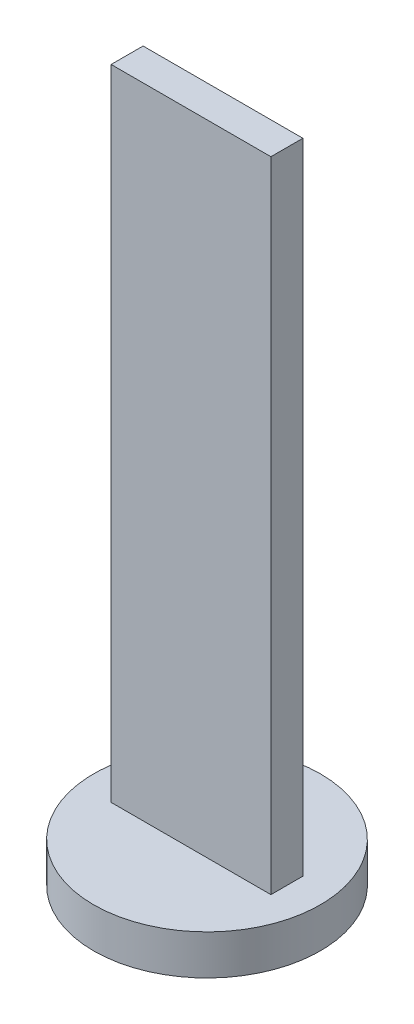
ISO-10303-21;
HEADER;
FILE_DESCRIPTION(('STEP AP214'),'2;1');
FILE_NAME('part.step','',(''),(''),'','','');
FILE_SCHEMA(('AUTOMOTIVE_DESIGN { 1 0 10303 214 1 1 1 1 }'));
ENDSEC;
DATA;
#1=APPLICATION_CONTEXT('core data for automotive mechanical design processes');
#2=APPLICATION_PROTOCOL_DEFINITION('international standard','automotive_design',2000,#1);
#3=PRODUCT_CONTEXT('',#1,'mechanical');
#4=PRODUCT('Part','Part','',(#3));
#5=PRODUCT_RELATED_PRODUCT_CATEGORY('part','',(#4));
#6=PRODUCT_DEFINITION_FORMATION('','',#4);
#7=PRODUCT_DEFINITION_CONTEXT('part definition',#1,'design');
#8=PRODUCT_DEFINITION('design','',#6,#7);
#9=PRODUCT_DEFINITION_SHAPE('','',#8);
#10=(LENGTH_UNIT() NAMED_UNIT(*) SI_UNIT(.MILLI.,.METRE.));
#11=(NAMED_UNIT(*) PLANE_ANGLE_UNIT() SI_UNIT($,.RADIAN.));
#12=(NAMED_UNIT(*) SI_UNIT($,.STERADIAN.) SOLID_ANGLE_UNIT());
#13=UNCERTAINTY_MEASURE_WITH_UNIT(LENGTH_MEASURE(1.E-05),#10,'distance_accuracy_value','');
#14=(GEOMETRIC_REPRESENTATION_CONTEXT(3) GLOBAL_UNCERTAINTY_ASSIGNED_CONTEXT((#13)) GLOBAL_UNIT_ASSIGNED_CONTEXT((#10,
#11,#12)) REPRESENTATION_CONTEXT('',''));
#15=CARTESIAN_POINT('',(0.,0.,0.));
#16=DIRECTION('',(0.,0.,1.));
#17=DIRECTION('',(1.,0.,0.));
#18=AXIS2_PLACEMENT_3D('',#15,#16,#17);
#19=CARTESIAN_POINT('',(0.5,-2.,0.1));
#20=DIRECTION('',(-1.,0.,0.));
#21=DIRECTION('',(0.,-1.,0.));
#22=AXIS2_PLACEMENT_3D('',#19,#20,#21);
#23=PLANE('',#22);
#24=DIRECTION('',(0.,1.,0.));
#25=VECTOR('',#24,1.);
#26=CARTESIAN_POINT('',(0.5,-2.,-0.1));
#27=LINE('',#26,#25);
#28=CARTESIAN_POINT('',(0.500000000000001,-2.,-0.1));
#29=VERTEX_POINT('',#28);
#30=CARTESIAN_POINT('',(0.500000000000001,2.,-0.1));
#31=VERTEX_POINT('',#30);
#32=EDGE_CURVE('E80',#29,#31,#27,.T.);
#33=ORIENTED_EDGE('',*,*,#32,.T.);
#34=DIRECTION('',(0.,0.,-1.));
#35=VECTOR('',#34,1.);
#36=CARTESIAN_POINT('',(0.500000000000001,2.,0.1));
#37=LINE('',#36,#35);
#38=CARTESIAN_POINT('',(0.500000000000001,2.,0.1));
#39=VERTEX_POINT('',#38);
#40=EDGE_CURVE('E11',#39,#31,#37,.T.);
#41=ORIENTED_EDGE('',*,*,#40,.F.);
#42=DIRECTION('',(0.,1.,0.));
#43=VECTOR('',#42,1.);
#44=CARTESIAN_POINT('',(0.5,-2.,0.1));
#45=LINE('',#44,#43);
#46=CARTESIAN_POINT('',(0.5,-2.,0.1));
#47=VERTEX_POINT('',#46);
#48=EDGE_CURVE('E92',#47,#39,#45,.T.);
#49=ORIENTED_EDGE('',*,*,#48,.F.);
#50=DIRECTION('',(0.,0.,-1.));
#51=VECTOR('',#50,1.);
#52=CARTESIAN_POINT('',(0.5,-2.,0.1));
#53=LINE('',#52,#51);
#54=EDGE_CURVE('E91',#47,#29,#53,.T.);
#55=ORIENTED_EDGE('',*,*,#54,.T.);
#56=EDGE_LOOP('',(#33,#41,#49,#55));
#57=FACE_BOUND('',#56,.T.);
#58=ADVANCED_FACE('F34',(#57),#23,.F.);
#59=CARTESIAN_POINT('',(-0.5,2.,0.1));
#60=DIRECTION('',(0.,-1.,0.));
#61=DIRECTION('',(1.,0.,0.));
#62=AXIS2_PLACEMENT_3D('',#59,#60,#61);
#63=PLANE('',#62);
#64=DIRECTION('',(-1.,0.,0.));
#65=VECTOR('',#64,1.);
#66=CARTESIAN_POINT('',(-0.5,2.,-0.1));
#67=LINE('',#66,#65);
#68=CARTESIAN_POINT('',(-0.5,2.,-0.1));
#69=VERTEX_POINT('',#68);
#70=EDGE_CURVE('E63',#31,#69,#67,.T.);
#71=ORIENTED_EDGE('',*,*,#70,.T.);
#72=DIRECTION('',(0.,0.,-1.));
#73=VECTOR('',#72,1.);
#74=CARTESIAN_POINT('',(-0.5,2.,0.1));
#75=LINE('',#74,#73);
#76=CARTESIAN_POINT('',(-0.5,2.,0.1));
#77=VERTEX_POINT('',#76);
#78=EDGE_CURVE('E42',#77,#69,#75,.T.);
#79=ORIENTED_EDGE('',*,*,#78,.F.);
#80=DIRECTION('',(-1.,0.,0.));
#81=VECTOR('',#80,1.);
#82=CARTESIAN_POINT('',(-0.5,2.,0.1));
#83=LINE('',#82,#81);
#84=EDGE_CURVE('E75',#39,#77,#83,.T.);
#85=ORIENTED_EDGE('',*,*,#84,.F.);
#86=ORIENTED_EDGE('',*,*,#40,.T.);
#87=EDGE_LOOP('',(#71,#79,#85,#86));
#88=FACE_BOUND('',#87,.T.);
#89=ADVANCED_FACE('F105',(#88),#63,.F.);
#90=CARTESIAN_POINT('',(-0.5,-2.,0.1));
#91=DIRECTION('',(1.,0.,0.));
#92=DIRECTION('',(0.,0.,-1.));
#93=AXIS2_PLACEMENT_3D('',#90,#91,#92);
#94=PLANE('',#93);
#95=DIRECTION('',(0.,-1.,0.));
#96=VECTOR('',#95,1.);
#97=CARTESIAN_POINT('',(-0.5,-2.,-0.1));
#98=LINE('',#97,#96);
#99=CARTESIAN_POINT('',(-0.5,-2.,-0.1));
#100=VERTEX_POINT('',#99);
#101=EDGE_CURVE('E70',#69,#100,#98,.T.);
#102=ORIENTED_EDGE('',*,*,#101,.T.);
#103=DIRECTION('',(0.,0.,-1.));
#104=VECTOR('',#103,1.);
#105=CARTESIAN_POINT('',(-0.5,-2.,0.1));
#106=LINE('',#105,#104);
#107=CARTESIAN_POINT('',(-0.5,-2.,0.1));
#108=VERTEX_POINT('',#107);
#109=EDGE_CURVE('E94',#108,#100,#106,.T.);
#110=ORIENTED_EDGE('',*,*,#109,.F.);
#111=DIRECTION('',(0.,-1.,0.));
#112=VECTOR('',#111,1.);
#113=CARTESIAN_POINT('',(-0.5,-2.,0.1));
#114=LINE('',#113,#112);
#115=EDGE_CURVE('E104',#77,#108,#114,.T.);
#116=ORIENTED_EDGE('',*,*,#115,.F.);
#117=ORIENTED_EDGE('',*,*,#78,.T.);
#118=EDGE_LOOP('',(#102,#110,#116,#117));
#119=FACE_BOUND('',#118,.T.);
#120=ADVANCED_FACE('F103',(#119),#94,.F.);
#121=CARTESIAN_POINT('',(0.,0.,0.1));
#122=DIRECTION('',(0.,0.,-1.));
#123=DIRECTION('',(-1.,0.,0.));
#124=AXIS2_PLACEMENT_3D('',#121,#122,#123);
#125=PLANE('',#124);
#126=ORIENTED_EDGE('',*,*,#48,.T.);
#127=ORIENTED_EDGE('',*,*,#84,.T.);
#128=ORIENTED_EDGE('',*,*,#115,.T.);
#129=DIRECTION('',(1.,0.,0.));
#130=VECTOR('',#129,1.);
#131=CARTESIAN_POINT('',(-0.5,-2.,0.1));
#132=LINE('',#131,#130);
#133=EDGE_CURVE('E50',#108,#47,#132,.T.);
#134=ORIENTED_EDGE('',*,*,#133,.T.);
#135=EDGE_LOOP('',(#126,#127,#128,#134));
#136=FACE_BOUND('',#135,.T.);
#137=ADVANCED_FACE('F111',(#136),#125,.F.);
#138=CARTESIAN_POINT('',(0.,0.,-0.1));
#139=DIRECTION('',(0.,0.,-1.));
#140=DIRECTION('',(-1.,0.,0.));
#141=AXIS2_PLACEMENT_3D('',#138,#139,#140);
#142=PLANE('',#141);
#143=ORIENTED_EDGE('',*,*,#32,.F.);
#144=DIRECTION('',(1.,0.,0.));
#145=VECTOR('',#144,1.);
#146=CARTESIAN_POINT('',(-0.5,-2.,-0.1));
#147=LINE('',#146,#145);
#148=EDGE_CURVE('E84',#100,#29,#147,.T.);
#149=ORIENTED_EDGE('',*,*,#148,.F.);
#150=ORIENTED_EDGE('',*,*,#101,.F.);
#151=ORIENTED_EDGE('',*,*,#70,.F.);
#152=EDGE_LOOP('',(#143,#149,#150,#151));
#153=FACE_BOUND('',#152,.T.);
#154=ADVANCED_FACE('F82',(#153),#142,.T.);
#155=CARTESIAN_POINT('',(0.,-2.,0.));
#156=DIRECTION('',(0.,-1.,0.));
#157=DIRECTION('',(0.,0.,-1.));
#158=AXIS2_PLACEMENT_3D('',#155,#156,#157);
#159=PLANE('',#158);
#160=CARTESIAN_POINT('',(0.,-2.,0.));
#161=DIRECTION('',(0.,-1.,0.));
#162=DIRECTION('',(0.,0.,-1.));
#163=AXIS2_PLACEMENT_3D('',#160,#161,#162);
#164=CIRCLE('',#163,0.709901951359279);
#165=CARTESIAN_POINT('',(0.,-2.,-0.709901951359279));
#166=VERTEX_POINT('',#165);
#167=EDGE_CURVE('E132',#166,#166,#164,.T.);
#168=ORIENTED_EDGE('',*,*,#167,.F.);
#169=EDGE_LOOP('',(#168));
#170=FACE_BOUND('',#169,.T.);
#171=ORIENTED_EDGE('',*,*,#54,.F.);
#172=ORIENTED_EDGE('',*,*,#133,.F.);
#173=ORIENTED_EDGE('',*,*,#109,.T.);
#174=ORIENTED_EDGE('',*,*,#148,.T.);
#175=EDGE_LOOP('',(#171,#172,#173,#174));
#176=FACE_BOUND('',#175,.T.);
#177=ADVANCED_FACE('F96',(#170,#176),#159,.F.);
#178=CARTESIAN_POINT('',(0.,-2.25,0.));
#179=DIRECTION('',(0.,1.,0.));
#180=DIRECTION('',(0.,0.,1.));
#181=AXIS2_PLACEMENT_3D('',#178,#179,#180);
#182=CYLINDRICAL_SURFACE('',#181,0.709901951359279);
#183=CARTESIAN_POINT('',(0.,-2.25,0.));
#184=DIRECTION('',(0.,-1.,0.));
#185=DIRECTION('',(0.,0.,-1.));
#186=AXIS2_PLACEMENT_3D('',#183,#184,#185);
#187=CIRCLE('',#186,0.709901951359279);
#188=CARTESIAN_POINT('',(0.,-2.25,-0.709901951359279));
#189=VERTEX_POINT('',#188);
#190=EDGE_CURVE('E88',#189,#189,#187,.T.);
#191=ORIENTED_EDGE('',*,*,#190,.F.);
#192=EDGE_LOOP('',(#191));
#193=FACE_BOUND('',#192,.T.);
#194=ORIENTED_EDGE('',*,*,#167,.T.);
#195=EDGE_LOOP('',(#194));
#196=FACE_BOUND('',#195,.T.);
#197=ADVANCED_FACE('F118',(#193,#196),#182,.T.);
#198=CARTESIAN_POINT('',(0.,-2.25,0.));
#199=DIRECTION('',(0.,-1.,0.));
#200=DIRECTION('',(0.,0.,-1.));
#201=AXIS2_PLACEMENT_3D('',#198,#199,#200);
#202=PLANE('',#201);
#203=ORIENTED_EDGE('',*,*,#190,.T.);
#204=EDGE_LOOP('',(#203));
#205=FACE_BOUND('',#204,.T.);
#206=ADVANCED_FACE('F121',(#205),#202,.T.);
#207=CLOSED_SHELL('',(#58,#89,#120,#137,#154,#177,#197,#206));
#208=MANIFOLD_SOLID_BREP('B2',#207);
#209=ADVANCED_BREP_SHAPE_REPRESENTATION('',(#18,#208),#14);
#210=SHAPE_DEFINITION_REPRESENTATION(#9,#209);
ENDSEC;
END-ISO-10303-21;
